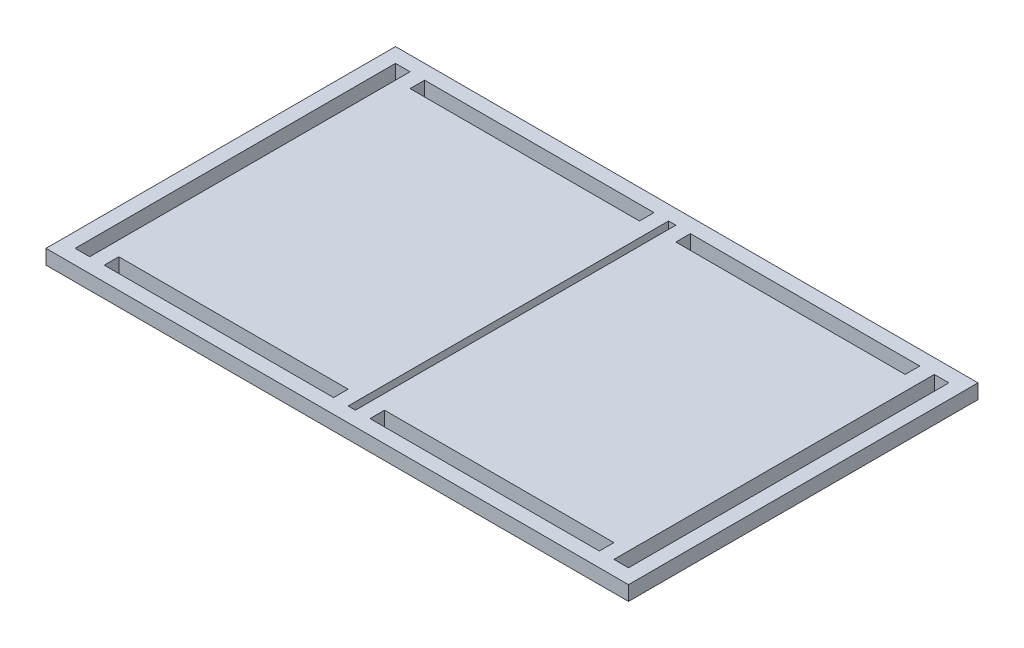
ISO-10303-21;
HEADER;
FILE_DESCRIPTION(('STEP AP214'),'2;1');
FILE_NAME('part.step','',(''),(''),'','','');
FILE_SCHEMA(('AUTOMOTIVE_DESIGN { 1 0 10303 214 1 1 1 1 }'));
ENDSEC;
DATA;
#1=APPLICATION_CONTEXT('core data for automotive mechanical design processes');
#2=APPLICATION_PROTOCOL_DEFINITION('international standard','automotive_design',2000,#1);
#3=PRODUCT_CONTEXT('',#1,'mechanical');
#4=PRODUCT('Part','Part','',(#3));
#5=PRODUCT_RELATED_PRODUCT_CATEGORY('part','',(#4));
#6=PRODUCT_DEFINITION_FORMATION('','',#4);
#7=PRODUCT_DEFINITION_CONTEXT('part definition',#1,'design');
#8=PRODUCT_DEFINITION('design','',#6,#7);
#9=PRODUCT_DEFINITION_SHAPE('','',#8);
#10=(LENGTH_UNIT() NAMED_UNIT(*) SI_UNIT(.MILLI.,.METRE.));
#11=(NAMED_UNIT(*) PLANE_ANGLE_UNIT() SI_UNIT($,.RADIAN.));
#12=(NAMED_UNIT(*) SI_UNIT($,.STERADIAN.) SOLID_ANGLE_UNIT());
#13=UNCERTAINTY_MEASURE_WITH_UNIT(LENGTH_MEASURE(1.E-05),#10,'distance_accuracy_value','');
#14=(GEOMETRIC_REPRESENTATION_CONTEXT(3) GLOBAL_UNCERTAINTY_ASSIGNED_CONTEXT((#13)) GLOBAL_UNIT_ASSIGNED_CONTEXT((#10,
#11,#12)) REPRESENTATION_CONTEXT('',''));
#15=CARTESIAN_POINT('',(0.,0.,0.));
#16=DIRECTION('',(0.,0.,1.));
#17=DIRECTION('',(1.,0.,0.));
#18=AXIS2_PLACEMENT_3D('',#15,#16,#17);
#19=CARTESIAN_POINT('',(-107.95,6.35,2.36111281758253E-13));
#20=DIRECTION('',(-1.,0.,0.));
#21=DIRECTION('',(0.,0.,1.));
#22=AXIS2_PLACEMENT_3D('',#19,#20,#21);
#23=PLANE('',#22);
#24=DIRECTION('',(0.,0.,-1.));
#25=VECTOR('',#24,1.);
#26=CARTESIAN_POINT('',(-107.95,0.,2.36111281758253E-13));
#27=LINE('',#26,#25);
#28=CARTESIAN_POINT('',(-107.95,0.,69.85));
#29=VERTEX_POINT('',#28);
#30=CARTESIAN_POINT('',(-107.95,0.,63.50508));
#31=VERTEX_POINT('',#30);
#32=EDGE_CURVE('E395',#29,#31,#27,.T.);
#33=ORIENTED_EDGE('',*,*,#32,.T.);
#34=DIRECTION('',(0.,-1.,0.));
#35=VECTOR('',#34,1.);
#36=CARTESIAN_POINT('',(-107.95,6.35,63.50508));
#37=LINE('',#36,#35);
#38=CARTESIAN_POINT('',(-107.95,6.35,63.50508));
#39=VERTEX_POINT('',#38);
#40=EDGE_CURVE('E11',#39,#31,#37,.T.);
#41=ORIENTED_EDGE('',*,*,#40,.F.);
#42=DIRECTION('',(0.,0.,-1.));
#43=VECTOR('',#42,1.);
#44=CARTESIAN_POINT('',(-107.95,6.35,2.36111281758253E-13));
#45=LINE('',#44,#43);
#46=CARTESIAN_POINT('',(-107.95,6.35,69.85));
#47=VERTEX_POINT('',#46);
#48=EDGE_CURVE('E263',#47,#39,#45,.T.);
#49=ORIENTED_EDGE('',*,*,#48,.F.);
#50=DIRECTION('',(0.,-1.,0.));
#51=VECTOR('',#50,1.);
#52=CARTESIAN_POINT('',(-107.95,6.35,69.85));
#53=LINE('',#52,#51);
#54=EDGE_CURVE('E59',#47,#29,#53,.T.);
#55=ORIENTED_EDGE('',*,*,#54,.T.);
#56=EDGE_LOOP('',(#33,#41,#49,#55));
#57=FACE_BOUND('',#56,.T.);
#58=ADVANCED_FACE('F39',(#57),#23,.F.);
#59=CARTESIAN_POINT('',(0.,6.35,63.50508));
#60=DIRECTION('',(0.,0.,-1.));
#61=DIRECTION('',(-1.,0.,0.));
#62=AXIS2_PLACEMENT_3D('',#59,#60,#61);
#63=PLANE('',#62);
#64=DIRECTION('',(1.,0.,0.));
#65=VECTOR('',#64,1.);
#66=CARTESIAN_POINT('',(0.,0.,63.50508));
#67=LINE('',#66,#65);
#68=CARTESIAN_POINT('',(-7.93750000000001,0.,63.50508));
#69=VERTEX_POINT('',#68);
#70=EDGE_CURVE('E270',#31,#69,#67,.T.);
#71=ORIENTED_EDGE('',*,*,#70,.T.);
#72=DIRECTION('',(0.,-1.,0.));
#73=VECTOR('',#72,1.);
#74=CARTESIAN_POINT('',(-7.93750000000001,6.35,63.50508));
#75=LINE('',#74,#73);
#76=CARTESIAN_POINT('',(-7.93750000000001,6.35,63.50508));
#77=VERTEX_POINT('',#76);
#78=EDGE_CURVE('E50',#77,#69,#75,.T.);
#79=ORIENTED_EDGE('',*,*,#78,.F.);
#80=DIRECTION('',(1.,0.,0.));
#81=VECTOR('',#80,1.);
#82=CARTESIAN_POINT('',(0.,6.35,63.50508));
#83=LINE('',#82,#81);
#84=EDGE_CURVE('E257',#39,#77,#83,.T.);
#85=ORIENTED_EDGE('',*,*,#84,.F.);
#86=ORIENTED_EDGE('',*,*,#40,.T.);
#87=EDGE_LOOP('',(#71,#79,#85,#86));
#88=FACE_BOUND('',#87,.T.);
#89=ADVANCED_FACE('F269',(#88),#63,.F.);
#90=CARTESIAN_POINT('',(-7.93749999999994,6.35,0.));
#91=DIRECTION('',(-1.,0.,0.));
#92=DIRECTION('',(0.,0.,1.));
#93=AXIS2_PLACEMENT_3D('',#90,#91,#92);
#94=PLANE('',#93);
#95=DIRECTION('',(0.,0.,-1.));
#96=VECTOR('',#95,1.);
#97=CARTESIAN_POINT('',(-7.93749999999994,0.,0.));
#98=LINE('',#97,#96);
#99=CARTESIAN_POINT('',(-7.93750000000001,0.,69.85));
#100=VERTEX_POINT('',#99);
#101=EDGE_CURVE('E400',#100,#69,#98,.T.);
#102=ORIENTED_EDGE('',*,*,#101,.F.);
#103=DIRECTION('',(0.,-1.,0.));
#104=VECTOR('',#103,1.);
#105=CARTESIAN_POINT('',(-7.93750000000001,6.35,69.85));
#106=LINE('',#105,#104);
#107=CARTESIAN_POINT('',(-7.93750000000001,6.35,69.85));
#108=VERTEX_POINT('',#107);
#109=EDGE_CURVE('E157',#108,#100,#106,.T.);
#110=ORIENTED_EDGE('',*,*,#109,.F.);
#111=DIRECTION('',(0.,0.,-1.));
#112=VECTOR('',#111,1.);
#113=CARTESIAN_POINT('',(-7.93749999999994,6.35,0.));
#114=LINE('',#113,#112);
#115=EDGE_CURVE('E262',#108,#77,#114,.T.);
#116=ORIENTED_EDGE('',*,*,#115,.T.);
#117=ORIENTED_EDGE('',*,*,#78,.T.);
#118=EDGE_LOOP('',(#102,#110,#116,#117));
#119=FACE_BOUND('',#118,.T.);
#120=ADVANCED_FACE('F275',(#119),#94,.T.);
#121=CARTESIAN_POINT('',(0.,6.35,63.51016));
#122=DIRECTION('',(0.,0.,-1.));
#123=DIRECTION('',(-1.,0.,0.));
#124=AXIS2_PLACEMENT_3D('',#121,#122,#123);
#125=PLANE('',#124);
#126=DIRECTION('',(1.,0.,0.));
#127=VECTOR('',#126,1.);
#128=CARTESIAN_POINT('',(0.,0.,63.51016));
#129=LINE('',#128,#127);
#130=CARTESIAN_POINT('',(7.93749999999999,0.,63.51016));
#131=VERTEX_POINT('',#130);
#132=CARTESIAN_POINT('',(107.95,0.,63.5101599999999));
#133=VERTEX_POINT('',#132);
#134=EDGE_CURVE('E379',#131,#133,#129,.T.);
#135=ORIENTED_EDGE('',*,*,#134,.T.);
#136=DIRECTION('',(0.,-1.,0.));
#137=VECTOR('',#136,1.);
#138=CARTESIAN_POINT('',(107.95,6.35,63.5101599999999));
#139=LINE('',#138,#137);
#140=CARTESIAN_POINT('',(107.95,6.35,63.5101599999999));
#141=VERTEX_POINT('',#140);
#142=EDGE_CURVE('E410',#141,#133,#139,.T.);
#143=ORIENTED_EDGE('',*,*,#142,.F.);
#144=DIRECTION('',(1.,0.,0.));
#145=VECTOR('',#144,1.);
#146=CARTESIAN_POINT('',(0.,6.35,63.51016));
#147=LINE('',#146,#145);
#148=CARTESIAN_POINT('',(7.93749999999999,6.35,63.51016));
#149=VERTEX_POINT('',#148);
#150=EDGE_CURVE('E601',#149,#141,#147,.T.);
#151=ORIENTED_EDGE('',*,*,#150,.F.);
#152=DIRECTION('',(0.,-1.,0.));
#153=VECTOR('',#152,1.);
#154=CARTESIAN_POINT('',(7.93749999999999,6.35,63.51016));
#155=LINE('',#154,#153);
#156=EDGE_CURVE('E413',#149,#131,#155,.T.);
#157=ORIENTED_EDGE('',*,*,#156,.T.);
#158=EDGE_LOOP('',(#135,#143,#151,#157));
#159=FACE_BOUND('',#158,.T.);
#160=ADVANCED_FACE('F632',(#159),#125,.F.);
#161=CARTESIAN_POINT('',(107.95,6.35,0.));
#162=DIRECTION('',(1.,0.,0.));
#163=DIRECTION('',(0.,0.,-1.));
#164=AXIS2_PLACEMENT_3D('',#161,#162,#163);
#165=PLANE('',#164);
#166=DIRECTION('',(0.,0.,1.));
#167=VECTOR('',#166,1.);
#168=CARTESIAN_POINT('',(107.95,0.,0.));
#169=LINE('',#168,#167);
#170=CARTESIAN_POINT('',(107.95,0.,69.85508));
#171=VERTEX_POINT('',#170);
#172=EDGE_CURVE('E383',#133,#171,#169,.T.);
#173=ORIENTED_EDGE('',*,*,#172,.T.);
#174=DIRECTION('',(0.,-1.,0.));
#175=VECTOR('',#174,1.);
#176=CARTESIAN_POINT('',(107.95,6.35,69.85508));
#177=LINE('',#176,#175);
#178=CARTESIAN_POINT('',(107.95,6.35,69.85508));
#179=VERTEX_POINT('',#178);
#180=EDGE_CURVE('E420',#179,#171,#177,.T.);
#181=ORIENTED_EDGE('',*,*,#180,.F.);
#182=DIRECTION('',(0.,0.,1.));
#183=VECTOR('',#182,1.);
#184=CARTESIAN_POINT('',(107.95,6.35,0.));
#185=LINE('',#184,#183);
#186=EDGE_CURVE('E605',#141,#179,#185,.T.);
#187=ORIENTED_EDGE('',*,*,#186,.F.);
#188=ORIENTED_EDGE('',*,*,#142,.T.);
#189=EDGE_LOOP('',(#173,#181,#187,#188));
#190=FACE_BOUND('',#189,.T.);
#191=ADVANCED_FACE('F634',(#190),#165,.F.);
#192=CARTESIAN_POINT('',(0.,6.35,69.85508));
#193=DIRECTION('',(0.,0.,-1.));
#194=DIRECTION('',(-1.,0.,0.));
#195=AXIS2_PLACEMENT_3D('',#192,#193,#194);
#196=PLANE('',#195);
#197=DIRECTION('',(1.,0.,0.));
#198=VECTOR('',#197,1.);
#199=CARTESIAN_POINT('',(0.,0.,69.85508));
#200=LINE('',#199,#198);
#201=CARTESIAN_POINT('',(7.93749999999999,0.,69.85508));
#202=VERTEX_POINT('',#201);
#203=EDGE_CURVE('E387',#202,#171,#200,.T.);
#204=ORIENTED_EDGE('',*,*,#203,.F.);
#205=DIRECTION('',(0.,-1.,0.));
#206=VECTOR('',#205,1.);
#207=CARTESIAN_POINT('',(7.93749999999999,6.35,69.85508));
#208=LINE('',#207,#206);
#209=CARTESIAN_POINT('',(7.93749999999999,6.35,69.85508));
#210=VERTEX_POINT('',#209);
#211=EDGE_CURVE('E416',#210,#202,#208,.T.);
#212=ORIENTED_EDGE('',*,*,#211,.F.);
#213=DIRECTION('',(1.,0.,0.));
#214=VECTOR('',#213,1.);
#215=CARTESIAN_POINT('',(0.,6.35,69.85508));
#216=LINE('',#215,#214);
#217=EDGE_CURVE('E608',#210,#179,#216,.T.);
#218=ORIENTED_EDGE('',*,*,#217,.T.);
#219=ORIENTED_EDGE('',*,*,#180,.T.);
#220=EDGE_LOOP('',(#204,#212,#218,#219));
#221=FACE_BOUND('',#220,.T.);
#222=ADVANCED_FACE('F627',(#221),#196,.T.);
#223=CARTESIAN_POINT('',(0.,6.35,-69.85));
#224=DIRECTION('',(0.,0.,-1.));
#225=DIRECTION('',(-1.,0.,0.));
#226=AXIS2_PLACEMENT_3D('',#223,#224,#225);
#227=PLANE('',#226);
#228=DIRECTION('',(1.,0.,0.));
#229=VECTOR('',#228,1.);
#230=CARTESIAN_POINT('',(0.,0.,-69.85));
#231=LINE('',#230,#229);
#232=CARTESIAN_POINT('',(-107.95,0.,-69.85));
#233=VERTEX_POINT('',#232);
#234=CARTESIAN_POINT('',(-7.93750000000001,0.,-69.85));
#235=VERTEX_POINT('',#234);
#236=EDGE_CURVE('E363',#233,#235,#231,.T.);
#237=ORIENTED_EDGE('',*,*,#236,.T.);
#238=DIRECTION('',(0.,-1.,0.));
#239=VECTOR('',#238,1.);
#240=CARTESIAN_POINT('',(-7.93750000000001,6.35,-69.85));
#241=LINE('',#240,#239);
#242=CARTESIAN_POINT('',(-7.93750000000001,6.35,-69.85));
#243=VERTEX_POINT('',#242);
#244=EDGE_CURVE('E417',#243,#235,#241,.T.);
#245=ORIENTED_EDGE('',*,*,#244,.F.);
#246=DIRECTION('',(1.,0.,0.));
#247=VECTOR('',#246,1.);
#248=CARTESIAN_POINT('',(0.,6.35,-69.85));
#249=LINE('',#248,#247);
#250=CARTESIAN_POINT('',(-107.95,6.35,-69.85));
#251=VERTEX_POINT('',#250);
#252=EDGE_CURVE('E586',#251,#243,#249,.T.);
#253=ORIENTED_EDGE('',*,*,#252,.F.);
#254=DIRECTION('',(0.,-1.,0.));
#255=VECTOR('',#254,1.);
#256=CARTESIAN_POINT('',(-107.95,6.35,-69.85));
#257=LINE('',#256,#255);
#258=EDGE_CURVE('E426',#251,#233,#257,.T.);
#259=ORIENTED_EDGE('',*,*,#258,.T.);
#260=EDGE_LOOP('',(#237,#245,#253,#259));
#261=FACE_BOUND('',#260,.T.);
#262=ADVANCED_FACE('F641',(#261),#227,.F.);
#263=CARTESIAN_POINT('',(-7.93749999999994,6.35,0.));
#264=DIRECTION('',(1.,0.,0.));
#265=DIRECTION('',(0.,0.,-1.));
#266=AXIS2_PLACEMENT_3D('',#263,#264,#265);
#267=PLANE('',#266);
#268=DIRECTION('',(0.,0.,1.));
#269=VECTOR('',#268,1.);
#270=CARTESIAN_POINT('',(-7.93749999999994,0.,0.));
#271=LINE('',#270,#269);
#272=CARTESIAN_POINT('',(-7.93750000000001,0.,-63.50508));
#273=VERTEX_POINT('',#272);
#274=EDGE_CURVE('E367',#235,#273,#271,.T.);
#275=ORIENTED_EDGE('',*,*,#274,.T.);
#276=DIRECTION('',(0.,-1.,0.));
#277=VECTOR('',#276,1.);
#278=CARTESIAN_POINT('',(-7.93750000000001,6.35,-63.50508));
#279=LINE('',#278,#277);
#280=CARTESIAN_POINT('',(-7.93750000000001,6.35,-63.50508));
#281=VERTEX_POINT('',#280);
#282=EDGE_CURVE('E433',#281,#273,#279,.T.);
#283=ORIENTED_EDGE('',*,*,#282,.F.);
#284=DIRECTION('',(0.,0.,1.));
#285=VECTOR('',#284,1.);
#286=CARTESIAN_POINT('',(-7.93749999999994,6.35,0.));
#287=LINE('',#286,#285);
#288=EDGE_CURVE('E590',#243,#281,#287,.T.);
#289=ORIENTED_EDGE('',*,*,#288,.F.);
#290=ORIENTED_EDGE('',*,*,#244,.T.);
#291=EDGE_LOOP('',(#275,#283,#289,#290));
#292=FACE_BOUND('',#291,.T.);
#293=ADVANCED_FACE('F735',(#292),#267,.F.);
#294=CARTESIAN_POINT('',(0.,6.35,-63.50508));
#295=DIRECTION('',(0.,0.,-1.));
#296=DIRECTION('',(-1.,0.,0.));
#297=AXIS2_PLACEMENT_3D('',#294,#295,#296);
#298=PLANE('',#297);
#299=DIRECTION('',(1.,0.,0.));
#300=VECTOR('',#299,1.);
#301=CARTESIAN_POINT('',(0.,0.,-63.50508));
#302=LINE('',#301,#300);
#303=CARTESIAN_POINT('',(-107.95,0.,-63.50508));
#304=VERTEX_POINT('',#303);
#305=EDGE_CURVE('E371',#304,#273,#302,.T.);
#306=ORIENTED_EDGE('',*,*,#305,.F.);
#307=DIRECTION('',(0.,-1.,0.));
#308=VECTOR('',#307,1.);
#309=CARTESIAN_POINT('',(-107.95,6.35,-63.50508));
#310=LINE('',#309,#308);
#311=CARTESIAN_POINT('',(-107.95,6.35,-63.50508));
#312=VERTEX_POINT('',#311);
#313=EDGE_CURVE('E429',#312,#304,#310,.T.);
#314=ORIENTED_EDGE('',*,*,#313,.F.);
#315=DIRECTION('',(1.,0.,0.));
#316=VECTOR('',#315,1.);
#317=CARTESIAN_POINT('',(0.,6.35,-63.50508));
#318=LINE('',#317,#316);
#319=EDGE_CURVE('E593',#312,#281,#318,.T.);
#320=ORIENTED_EDGE('',*,*,#319,.T.);
#321=ORIENTED_EDGE('',*,*,#282,.T.);
#322=EDGE_LOOP('',(#306,#314,#320,#321));
#323=FACE_BOUND('',#322,.T.);
#324=ADVANCED_FACE('F722',(#323),#298,.T.);
#325=CARTESIAN_POINT('',(-120.65,6.35,0.));
#326=DIRECTION('',(-1.,0.,0.));
#327=DIRECTION('',(0.,0.,1.));
#328=AXIS2_PLACEMENT_3D('',#325,#326,#327);
#329=PLANE('',#328);
#330=DIRECTION('',(0.,0.,-1.));
#331=VECTOR('',#330,1.);
#332=CARTESIAN_POINT('',(-120.65,0.,0.));
#333=LINE('',#332,#331);
#334=CARTESIAN_POINT('',(-120.65,0.,69.85));
#335=VERTEX_POINT('',#334);
#336=CARTESIAN_POINT('',(-120.65,0.,-69.85));
#337=VERTEX_POINT('',#336);
#338=EDGE_CURVE('E347',#335,#337,#333,.T.);
#339=ORIENTED_EDGE('',*,*,#338,.T.);
#340=DIRECTION('',(0.,-1.,0.));
#341=VECTOR('',#340,1.);
#342=CARTESIAN_POINT('',(-120.65,6.35,-69.85));
#343=LINE('',#342,#341);
#344=CARTESIAN_POINT('',(-120.65,6.35,-69.85));
#345=VERTEX_POINT('',#344);
#346=EDGE_CURVE('E430',#345,#337,#343,.T.);
#347=ORIENTED_EDGE('',*,*,#346,.F.);
#348=DIRECTION('',(0.,0.,-1.));
#349=VECTOR('',#348,1.);
#350=CARTESIAN_POINT('',(-120.65,6.35,0.));
#351=LINE('',#350,#349);
#352=CARTESIAN_POINT('',(-120.65,6.35,69.85));
#353=VERTEX_POINT('',#352);
#354=EDGE_CURVE('E571',#353,#345,#351,.T.);
#355=ORIENTED_EDGE('',*,*,#354,.F.);
#356=DIRECTION('',(0.,-1.,0.));
#357=VECTOR('',#356,1.);
#358=CARTESIAN_POINT('',(-120.65,6.35,69.85));
#359=LINE('',#358,#357);
#360=EDGE_CURVE('E439',#353,#335,#359,.T.);
#361=ORIENTED_EDGE('',*,*,#360,.T.);
#362=EDGE_LOOP('',(#339,#347,#355,#361));
#363=FACE_BOUND('',#362,.T.);
#364=ADVANCED_FACE('F718',(#363),#329,.F.);
#365=CARTESIAN_POINT('',(0.,6.35,-69.85));
#366=DIRECTION('',(0.,0.,-1.));
#367=DIRECTION('',(-1.,0.,0.));
#368=AXIS2_PLACEMENT_3D('',#365,#366,#367);
#369=PLANE('',#368);
#370=DIRECTION('',(1.,0.,0.));
#371=VECTOR('',#370,1.);
#372=CARTESIAN_POINT('',(0.,0.,-69.85));
#373=LINE('',#372,#371);
#374=CARTESIAN_POINT('',(-114.3,0.,-69.85));
#375=VERTEX_POINT('',#374);
#376=EDGE_CURVE('E351',#337,#375,#373,.T.);
#377=ORIENTED_EDGE('',*,*,#376,.T.);
#378=DIRECTION('',(0.,-1.,0.));
#379=VECTOR('',#378,1.);
#380=CARTESIAN_POINT('',(-114.3,6.35,-69.85));
#381=LINE('',#380,#379);
#382=CARTESIAN_POINT('',(-114.3,6.35,-69.85));
#383=VERTEX_POINT('',#382);
#384=EDGE_CURVE('E446',#383,#375,#381,.T.);
#385=ORIENTED_EDGE('',*,*,#384,.F.);
#386=DIRECTION('',(1.,0.,0.));
#387=VECTOR('',#386,1.);
#388=CARTESIAN_POINT('',(0.,6.35,-69.85));
#389=LINE('',#388,#387);
#390=EDGE_CURVE('E575',#345,#383,#389,.T.);
#391=ORIENTED_EDGE('',*,*,#390,.F.);
#392=ORIENTED_EDGE('',*,*,#346,.T.);
#393=EDGE_LOOP('',(#377,#385,#391,#392));
#394=FACE_BOUND('',#393,.T.);
#395=ADVANCED_FACE('F721',(#394),#369,.F.);
#396=CARTESIAN_POINT('',(-114.3,6.35,0.));
#397=DIRECTION('',(-1.,0.,0.));
#398=DIRECTION('',(0.,0.,1.));
#399=AXIS2_PLACEMENT_3D('',#396,#397,#398);
#400=PLANE('',#399);
#401=DIRECTION('',(0.,0.,-1.));
#402=VECTOR('',#401,1.);
#403=CARTESIAN_POINT('',(-114.3,0.,0.));
#404=LINE('',#403,#402);
#405=CARTESIAN_POINT('',(-114.3,0.,69.85));
#406=VERTEX_POINT('',#405);
#407=EDGE_CURVE('E355',#406,#375,#404,.T.);
#408=ORIENTED_EDGE('',*,*,#407,.F.);
#409=DIRECTION('',(0.,-1.,0.));
#410=VECTOR('',#409,1.);
#411=CARTESIAN_POINT('',(-114.3,6.35,69.85));
#412=LINE('',#411,#410);
#413=CARTESIAN_POINT('',(-114.3,6.35,69.85));
#414=VERTEX_POINT('',#413);
#415=EDGE_CURVE('E442',#414,#406,#412,.T.);
#416=ORIENTED_EDGE('',*,*,#415,.F.);
#417=DIRECTION('',(0.,0.,-1.));
#418=VECTOR('',#417,1.);
#419=CARTESIAN_POINT('',(-114.3,6.35,0.));
#420=LINE('',#419,#418);
#421=EDGE_CURVE('E578',#414,#383,#420,.T.);
#422=ORIENTED_EDGE('',*,*,#421,.T.);
#423=ORIENTED_EDGE('',*,*,#384,.T.);
#424=EDGE_LOOP('',(#408,#416,#422,#423));
#425=FACE_BOUND('',#424,.T.);
#426=ADVANCED_FACE('F707',(#425),#400,.T.);
#427=CARTESIAN_POINT('',(0.,6.35,69.8500000000001));
#428=DIRECTION('',(0.,0.,1.));
#429=DIRECTION('',(1.,0.,0.));
#430=AXIS2_PLACEMENT_3D('',#427,#428,#429);
#431=PLANE('',#430);
#432=DIRECTION('',(-1.,0.,0.));
#433=VECTOR('',#432,1.);
#434=CARTESIAN_POINT('',(0.,0.,69.8500000000001));
#435=LINE('',#434,#433);
#436=CARTESIAN_POINT('',(1.58749999999999,0.,69.8500000000001));
#437=VERTEX_POINT('',#436);
#438=CARTESIAN_POINT('',(-1.58750000000001,0.,69.8500000000001));
#439=VERTEX_POINT('',#438);
#440=EDGE_CURVE('E331',#437,#439,#435,.T.);
#441=ORIENTED_EDGE('',*,*,#440,.T.);
#442=DIRECTION('',(0.,-1.,0.));
#443=VECTOR('',#442,1.);
#444=CARTESIAN_POINT('',(-1.58750000000001,6.35,69.8500000000001));
#445=LINE('',#444,#443);
#446=CARTESIAN_POINT('',(-1.58750000000001,6.35,69.8500000000001));
#447=VERTEX_POINT('',#446);
#448=EDGE_CURVE('E443',#447,#439,#445,.T.);
#449=ORIENTED_EDGE('',*,*,#448,.F.);
#450=DIRECTION('',(-1.,0.,0.));
#451=VECTOR('',#450,1.);
#452=CARTESIAN_POINT('',(0.,6.35,69.8500000000001));
#453=LINE('',#452,#451);
#454=CARTESIAN_POINT('',(1.58749999999999,6.35,69.8500000000001));
#455=VERTEX_POINT('',#454);
#456=EDGE_CURVE('E556',#455,#447,#453,.T.);
#457=ORIENTED_EDGE('',*,*,#456,.F.);
#458=DIRECTION('',(0.,-1.,0.));
#459=VECTOR('',#458,1.);
#460=CARTESIAN_POINT('',(1.58749999999999,6.35,69.8500000000001));
#461=LINE('',#460,#459);
#462=EDGE_CURVE('E452',#455,#437,#461,.T.);
#463=ORIENTED_EDGE('',*,*,#462,.T.);
#464=EDGE_LOOP('',(#441,#449,#457,#463));
#465=FACE_BOUND('',#464,.T.);
#466=ADVANCED_FACE('F703',(#465),#431,.F.);
#467=CARTESIAN_POINT('',(-1.58750000000001,6.35,0.));
#468=DIRECTION('',(-1.,0.,0.));
#469=DIRECTION('',(0.,0.,1.));
#470=AXIS2_PLACEMENT_3D('',#467,#468,#469);
#471=PLANE('',#470);
#472=DIRECTION('',(0.,0.,-1.));
#473=VECTOR('',#472,1.);
#474=CARTESIAN_POINT('',(-1.58750000000001,0.,0.));
#475=LINE('',#474,#473);
#476=CARTESIAN_POINT('',(-1.58750000000001,0.,-69.85));
#477=VERTEX_POINT('',#476);
#478=EDGE_CURVE('E335',#439,#477,#475,.T.);
#479=ORIENTED_EDGE('',*,*,#478,.T.);
#480=DIRECTION('',(0.,-1.,0.));
#481=VECTOR('',#480,1.);
#482=CARTESIAN_POINT('',(-1.58750000000001,6.35,-69.85));
#483=LINE('',#482,#481);
#484=CARTESIAN_POINT('',(-1.58750000000001,6.35,-69.85));
#485=VERTEX_POINT('',#484);
#486=EDGE_CURVE('E459',#485,#477,#483,.T.);
#487=ORIENTED_EDGE('',*,*,#486,.F.);
#488=DIRECTION('',(0.,0.,-1.));
#489=VECTOR('',#488,1.);
#490=CARTESIAN_POINT('',(-1.58750000000001,6.35,0.));
#491=LINE('',#490,#489);
#492=EDGE_CURVE('E560',#447,#485,#491,.T.);
#493=ORIENTED_EDGE('',*,*,#492,.F.);
#494=ORIENTED_EDGE('',*,*,#448,.T.);
#495=EDGE_LOOP('',(#479,#487,#493,#494));
#496=FACE_BOUND('',#495,.T.);
#497=ADVANCED_FACE('F706',(#496),#471,.F.);
#498=CARTESIAN_POINT('',(0.,6.35,-69.85));
#499=DIRECTION('',(0.,0.,1.));
#500=DIRECTION('',(1.,0.,0.));
#501=AXIS2_PLACEMENT_3D('',#498,#499,#500);
#502=PLANE('',#501);
#503=DIRECTION('',(-1.,0.,0.));
#504=VECTOR('',#503,1.);
#505=CARTESIAN_POINT('',(0.,0.,-69.85));
#506=LINE('',#505,#504);
#507=CARTESIAN_POINT('',(1.58749999999999,0.,-69.85));
#508=VERTEX_POINT('',#507);
#509=EDGE_CURVE('E339',#508,#477,#506,.T.);
#510=ORIENTED_EDGE('',*,*,#509,.F.);
#511=DIRECTION('',(0.,-1.,0.));
#512=VECTOR('',#511,1.);
#513=CARTESIAN_POINT('',(1.58749999999999,6.35,-69.85));
#514=LINE('',#513,#512);
#515=CARTESIAN_POINT('',(1.58749999999999,6.35,-69.85));
#516=VERTEX_POINT('',#515);
#517=EDGE_CURVE('E455',#516,#508,#514,.T.);
#518=ORIENTED_EDGE('',*,*,#517,.F.);
#519=DIRECTION('',(-1.,0.,0.));
#520=VECTOR('',#519,1.);
#521=CARTESIAN_POINT('',(0.,6.35,-69.85));
#522=LINE('',#521,#520);
#523=EDGE_CURVE('E563',#516,#485,#522,.T.);
#524=ORIENTED_EDGE('',*,*,#523,.T.);
#525=ORIENTED_EDGE('',*,*,#486,.T.);
#526=EDGE_LOOP('',(#510,#518,#524,#525));
#527=FACE_BOUND('',#526,.T.);
#528=ADVANCED_FACE('F691',(#527),#502,.T.);
#529=CARTESIAN_POINT('',(3.05311331771917E-13,6.35,69.8500000000005));
#530=DIRECTION('',(0.,0.,1.));
#531=DIRECTION('',(1.,0.,0.));
#532=AXIS2_PLACEMENT_3D('',#529,#530,#531);
#533=PLANE('',#532);
#534=DIRECTION('',(-1.,0.,0.));
#535=VECTOR('',#534,1.);
#536=CARTESIAN_POINT('',(3.05311331771917E-13,0.,69.8500000000005));
#537=LINE('',#536,#535);
#538=CARTESIAN_POINT('',(120.65,0.,69.85));
#539=VERTEX_POINT('',#538);
#540=CARTESIAN_POINT('',(114.3,0.,69.85));
#541=VERTEX_POINT('',#540);
#542=EDGE_CURVE('E315',#539,#541,#537,.T.);
#543=ORIENTED_EDGE('',*,*,#542,.T.);
#544=DIRECTION('',(0.,-1.,0.));
#545=VECTOR('',#544,1.);
#546=CARTESIAN_POINT('',(114.3,6.35,69.85));
#547=LINE('',#546,#545);
#548=CARTESIAN_POINT('',(114.3,6.35,69.85));
#549=VERTEX_POINT('',#548);
#550=EDGE_CURVE('E456',#549,#541,#547,.T.);
#551=ORIENTED_EDGE('',*,*,#550,.F.);
#552=DIRECTION('',(-1.,0.,0.));
#553=VECTOR('',#552,1.);
#554=CARTESIAN_POINT('',(3.05311331771917E-13,6.35,69.8500000000005));
#555=LINE('',#554,#553);
#556=CARTESIAN_POINT('',(120.65,6.35,69.85));
#557=VERTEX_POINT('',#556);
#558=EDGE_CURVE('E541',#557,#549,#555,.T.);
#559=ORIENTED_EDGE('',*,*,#558,.F.);
#560=DIRECTION('',(0.,-1.,0.));
#561=VECTOR('',#560,1.);
#562=CARTESIAN_POINT('',(120.65,6.35,69.85));
#563=LINE('',#562,#561);
#564=EDGE_CURVE('E465',#557,#539,#563,.T.);
#565=ORIENTED_EDGE('',*,*,#564,.T.);
#566=EDGE_LOOP('',(#543,#551,#559,#565));
#567=FACE_BOUND('',#566,.T.);
#568=ADVANCED_FACE('F687',(#567),#533,.F.);
#569=CARTESIAN_POINT('',(114.3,6.35,0.));
#570=DIRECTION('',(-1.,0.,0.));
#571=DIRECTION('',(0.,0.,1.));
#572=AXIS2_PLACEMENT_3D('',#569,#570,#571);
#573=PLANE('',#572);
#574=DIRECTION('',(0.,0.,-1.));
#575=VECTOR('',#574,1.);
#576=CARTESIAN_POINT('',(114.3,0.,0.));
#577=LINE('',#576,#575);
#578=CARTESIAN_POINT('',(114.3,0.,-69.85));
#579=VERTEX_POINT('',#578);
#580=EDGE_CURVE('E319',#541,#579,#577,.T.);
#581=ORIENTED_EDGE('',*,*,#580,.T.);
#582=DIRECTION('',(0.,-1.,0.));
#583=VECTOR('',#582,1.);
#584=CARTESIAN_POINT('',(114.3,6.35,-69.85));
#585=LINE('',#584,#583);
#586=CARTESIAN_POINT('',(114.3,6.35,-69.85));
#587=VERTEX_POINT('',#586);
#588=EDGE_CURVE('E472',#587,#579,#585,.T.);
#589=ORIENTED_EDGE('',*,*,#588,.F.);
#590=DIRECTION('',(0.,0.,-1.));
#591=VECTOR('',#590,1.);
#592=CARTESIAN_POINT('',(114.3,6.35,0.));
#593=LINE('',#592,#591);
#594=EDGE_CURVE('E545',#549,#587,#593,.T.);
#595=ORIENTED_EDGE('',*,*,#594,.F.);
#596=ORIENTED_EDGE('',*,*,#550,.T.);
#597=EDGE_LOOP('',(#581,#589,#595,#596));
#598=FACE_BOUND('',#597,.T.);
#599=ADVANCED_FACE('F690',(#598),#573,.F.);
#600=CARTESIAN_POINT('',(-3.05311331771912E-13,6.35,-69.8499999999995));
#601=DIRECTION('',(0.,0.,1.));
#602=DIRECTION('',(1.,0.,0.));
#603=AXIS2_PLACEMENT_3D('',#600,#601,#602);
#604=PLANE('',#603);
#605=DIRECTION('',(-1.,0.,0.));
#606=VECTOR('',#605,1.);
#607=CARTESIAN_POINT('',(-3.05311331771912E-13,0.,-69.8499999999995));
#608=LINE('',#607,#606);
#609=CARTESIAN_POINT('',(120.65,0.,-69.85));
#610=VERTEX_POINT('',#609);
#611=EDGE_CURVE('E323',#610,#579,#608,.T.);
#612=ORIENTED_EDGE('',*,*,#611,.F.);
#613=DIRECTION('',(0.,-1.,0.));
#614=VECTOR('',#613,1.);
#615=CARTESIAN_POINT('',(120.65,6.35,-69.85));
#616=LINE('',#615,#614);
#617=CARTESIAN_POINT('',(120.65,6.35,-69.85));
#618=VERTEX_POINT('',#617);
#619=EDGE_CURVE('E468',#618,#610,#616,.T.);
#620=ORIENTED_EDGE('',*,*,#619,.F.);
#621=DIRECTION('',(-1.,0.,0.));
#622=VECTOR('',#621,1.);
#623=CARTESIAN_POINT('',(-3.05311331771912E-13,6.35,-69.8499999999995));
#624=LINE('',#623,#622);
#625=EDGE_CURVE('E548',#618,#587,#624,.T.);
#626=ORIENTED_EDGE('',*,*,#625,.T.);
#627=ORIENTED_EDGE('',*,*,#588,.T.);
#628=EDGE_LOOP('',(#612,#620,#626,#627));
#629=FACE_BOUND('',#628,.T.);
#630=ADVANCED_FACE('F674',(#629),#604,.T.);
#631=CARTESIAN_POINT('',(-127.,6.35,0.));
#632=DIRECTION('',(-1.,0.,0.));
#633=DIRECTION('',(0.,0.,1.));
#634=AXIS2_PLACEMENT_3D('',#631,#632,#633);
#635=PLANE('',#634);
#636=DIRECTION('',(0.,0.,-1.));
#637=VECTOR('',#636,1.);
#638=CARTESIAN_POINT('',(-127.,0.,0.));
#639=LINE('',#638,#637);
#640=CARTESIAN_POINT('',(-127.,0.,76.2));
#641=VERTEX_POINT('',#640);
#642=CARTESIAN_POINT('',(-127.,0.,-76.2));
#643=VERTEX_POINT('',#642);
#644=EDGE_CURVE('E299',#641,#643,#639,.T.);
#645=ORIENTED_EDGE('',*,*,#644,.F.);
#646=DIRECTION('',(0.,-1.,0.));
#647=VECTOR('',#646,1.);
#648=CARTESIAN_POINT('',(-127.,6.35,76.2));
#649=LINE('',#648,#647);
#650=CARTESIAN_POINT('',(-127.,6.35,76.2));
#651=VERTEX_POINT('',#650);
#652=EDGE_CURVE('E469',#651,#641,#649,.T.);
#653=ORIENTED_EDGE('',*,*,#652,.F.);
#654=DIRECTION('',(0.,0.,-1.));
#655=VECTOR('',#654,1.);
#656=CARTESIAN_POINT('',(-127.,6.35,0.));
#657=LINE('',#656,#655);
#658=CARTESIAN_POINT('',(-127.,6.35,-76.2));
#659=VERTEX_POINT('',#658);
#660=EDGE_CURVE('E520',#651,#659,#657,.T.);
#661=ORIENTED_EDGE('',*,*,#660,.T.);
#662=DIRECTION('',(0.,-1.,0.));
#663=VECTOR('',#662,1.);
#664=CARTESIAN_POINT('',(-127.,6.35,-76.2));
#665=LINE('',#664,#663);
#666=EDGE_CURVE('E478',#659,#643,#665,.T.);
#667=ORIENTED_EDGE('',*,*,#666,.T.);
#668=EDGE_LOOP('',(#645,#653,#661,#667));
#669=FACE_BOUND('',#668,.T.);
#670=ADVANCED_FACE('F670',(#669),#635,.T.);
#671=CARTESIAN_POINT('',(0.,6.35,76.2));
#672=DIRECTION('',(0.,0.,1.));
#673=DIRECTION('',(1.,0.,0.));
#674=AXIS2_PLACEMENT_3D('',#671,#672,#673);
#675=PLANE('',#674);
#676=DIRECTION('',(-1.,0.,0.));
#677=VECTOR('',#676,1.);
#678=CARTESIAN_POINT('',(0.,0.,76.2));
#679=LINE('',#678,#677);
#680=CARTESIAN_POINT('',(127.,0.,76.2));
#681=VERTEX_POINT('',#680);
#682=EDGE_CURVE('E303',#681,#641,#679,.T.);
#683=ORIENTED_EDGE('',*,*,#682,.F.);
#684=DIRECTION('',(0.,-1.,0.));
#685=VECTOR('',#684,1.);
#686=CARTESIAN_POINT('',(127.,6.35,76.2));
#687=LINE('',#686,#685);
#688=CARTESIAN_POINT('',(127.,6.35,76.2));
#689=VERTEX_POINT('',#688);
#690=EDGE_CURVE('E485',#689,#681,#687,.T.);
#691=ORIENTED_EDGE('',*,*,#690,.F.);
#692=DIRECTION('',(-1.,0.,0.));
#693=VECTOR('',#692,1.);
#694=CARTESIAN_POINT('',(0.,6.35,76.2));
#695=LINE('',#694,#693);
#696=EDGE_CURVE('E526',#689,#651,#695,.T.);
#697=ORIENTED_EDGE('',*,*,#696,.T.);
#698=ORIENTED_EDGE('',*,*,#652,.T.);
#699=EDGE_LOOP('',(#683,#691,#697,#698));
#700=FACE_BOUND('',#699,.T.);
#701=ADVANCED_FACE('F673',(#700),#675,.T.);
#702=CARTESIAN_POINT('',(127.,6.35,0.));
#703=DIRECTION('',(-1.,0.,0.));
#704=DIRECTION('',(0.,0.,1.));
#705=AXIS2_PLACEMENT_3D('',#702,#703,#704);
#706=PLANE('',#705);
#707=DIRECTION('',(0.,0.,-1.));
#708=VECTOR('',#707,1.);
#709=CARTESIAN_POINT('',(127.,0.,0.));
#710=LINE('',#709,#708);
#711=CARTESIAN_POINT('',(127.,0.,-76.2));
#712=VERTEX_POINT('',#711);
#713=EDGE_CURVE('E307',#681,#712,#710,.T.);
#714=ORIENTED_EDGE('',*,*,#713,.T.);
#715=DIRECTION('',(0.,-1.,0.));
#716=VECTOR('',#715,1.);
#717=CARTESIAN_POINT('',(127.,6.35,-76.2));
#718=LINE('',#717,#716);
#719=CARTESIAN_POINT('',(127.,6.35,-76.2));
#720=VERTEX_POINT('',#719);
#721=EDGE_CURVE('E481',#720,#712,#718,.T.);
#722=ORIENTED_EDGE('',*,*,#721,.F.);
#723=DIRECTION('',(0.,0.,-1.));
#724=VECTOR('',#723,1.);
#725=CARTESIAN_POINT('',(127.,6.35,0.));
#726=LINE('',#725,#724);
#727=EDGE_CURVE('E534',#689,#720,#726,.T.);
#728=ORIENTED_EDGE('',*,*,#727,.F.);
#729=ORIENTED_EDGE('',*,*,#690,.T.);
#730=EDGE_LOOP('',(#714,#722,#728,#729));
#731=FACE_BOUND('',#730,.T.);
#732=ADVANCED_FACE('F678',(#731),#706,.F.);
#733=CARTESIAN_POINT('',(107.95,6.35,0.));
#734=DIRECTION('',(-1.,0.,0.));
#735=DIRECTION('',(0.,0.,1.));
#736=AXIS2_PLACEMENT_3D('',#733,#734,#735);
#737=PLANE('',#736);
#738=DIRECTION('',(0.,0.,-1.));
#739=VECTOR('',#738,1.);
#740=CARTESIAN_POINT('',(107.95,0.,0.));
#741=LINE('',#740,#739);
#742=CARTESIAN_POINT('',(107.95,0.,-63.50508));
#743=VERTEX_POINT('',#742);
#744=CARTESIAN_POINT('',(107.95,0.,-69.85));
#745=VERTEX_POINT('',#744);
#746=EDGE_CURVE('E284',#743,#745,#741,.T.);
#747=ORIENTED_EDGE('',*,*,#746,.F.);
#748=DIRECTION('',(0.,-1.,0.));
#749=VECTOR('',#748,1.);
#750=CARTESIAN_POINT('',(107.95,6.35,-63.50508));
#751=LINE('',#750,#749);
#752=CARTESIAN_POINT('',(107.95,6.35,-63.50508));
#753=VERTEX_POINT('',#752);
#754=EDGE_CURVE('E43',#753,#743,#751,.T.);
#755=ORIENTED_EDGE('',*,*,#754,.F.);
#756=DIRECTION('',(0.,0.,-1.));
#757=VECTOR('',#756,1.);
#758=CARTESIAN_POINT('',(107.95,6.35,0.));
#759=LINE('',#758,#757);
#760=CARTESIAN_POINT('',(107.95,6.35,-69.85));
#761=VERTEX_POINT('',#760);
#762=EDGE_CURVE('E407',#753,#761,#759,.T.);
#763=ORIENTED_EDGE('',*,*,#762,.T.);
#764=DIRECTION('',(0.,-1.,0.));
#765=VECTOR('',#764,1.);
#766=CARTESIAN_POINT('',(107.95,6.35,-69.85));
#767=LINE('',#766,#765);
#768=EDGE_CURVE('E280',#761,#745,#767,.T.);
#769=ORIENTED_EDGE('',*,*,#768,.T.);
#770=EDGE_LOOP('',(#747,#755,#763,#769));
#771=FACE_BOUND('',#770,.T.);
#772=ADVANCED_FACE('F41',(#771),#737,.T.);
#773=CARTESIAN_POINT('',(0.,6.35,-63.50508));
#774=DIRECTION('',(0.,0.,-1.));
#775=DIRECTION('',(-1.,0.,0.));
#776=AXIS2_PLACEMENT_3D('',#773,#774,#775);
#777=PLANE('',#776);
#778=DIRECTION('',(1.,0.,0.));
#779=VECTOR('',#778,1.);
#780=CARTESIAN_POINT('',(0.,0.,-63.50508));
#781=LINE('',#780,#779);
#782=CARTESIAN_POINT('',(7.93749999999999,0.,-63.50508));
#783=VERTEX_POINT('',#782);
#784=EDGE_CURVE('E288',#783,#743,#781,.T.);
#785=ORIENTED_EDGE('',*,*,#784,.F.);
#786=DIRECTION('',(0.,-1.,0.));
#787=VECTOR('',#786,1.);
#788=CARTESIAN_POINT('',(7.93749999999999,6.35,-63.50508));
#789=LINE('',#788,#787);
#790=CARTESIAN_POINT('',(7.93749999999999,6.35,-63.50508));
#791=VERTEX_POINT('',#790);
#792=EDGE_CURVE('E495',#791,#783,#789,.T.);
#793=ORIENTED_EDGE('',*,*,#792,.F.);
#794=DIRECTION('',(1.,0.,0.));
#795=VECTOR('',#794,1.);
#796=CARTESIAN_POINT('',(0.,6.35,-63.50508));
#797=LINE('',#796,#795);
#798=EDGE_CURVE('E506',#791,#753,#797,.T.);
#799=ORIENTED_EDGE('',*,*,#798,.T.);
#800=ORIENTED_EDGE('',*,*,#754,.T.);
#801=EDGE_LOOP('',(#785,#793,#799,#800));
#802=FACE_BOUND('',#801,.T.);
#803=ADVANCED_FACE('F504',(#802),#777,.T.);
#804=CARTESIAN_POINT('',(7.93749999999999,6.35,0.));
#805=DIRECTION('',(-1.,0.,0.));
#806=DIRECTION('',(0.,0.,1.));
#807=AXIS2_PLACEMENT_3D('',#804,#805,#806);
#808=PLANE('',#807);
#809=DIRECTION('',(0.,0.,-1.));
#810=VECTOR('',#809,1.);
#811=CARTESIAN_POINT('',(7.93749999999999,0.,0.));
#812=LINE('',#811,#810);
#813=CARTESIAN_POINT('',(7.93749999999999,0.,-69.85));
#814=VERTEX_POINT('',#813);
#815=EDGE_CURVE('E292',#783,#814,#812,.T.);
#816=ORIENTED_EDGE('',*,*,#815,.T.);
#817=DIRECTION('',(0.,-1.,0.));
#818=VECTOR('',#817,1.);
#819=CARTESIAN_POINT('',(7.93749999999999,6.35,-69.85));
#820=LINE('',#819,#818);
#821=CARTESIAN_POINT('',(7.93749999999999,6.35,-69.85));
#822=VERTEX_POINT('',#821);
#823=EDGE_CURVE('E492',#822,#814,#820,.T.);
#824=ORIENTED_EDGE('',*,*,#823,.F.);
#825=DIRECTION('',(0.,0.,-1.));
#826=VECTOR('',#825,1.);
#827=CARTESIAN_POINT('',(7.93749999999999,6.35,0.));
#828=LINE('',#827,#826);
#829=EDGE_CURVE('E521',#791,#822,#828,.T.);
#830=ORIENTED_EDGE('',*,*,#829,.F.);
#831=ORIENTED_EDGE('',*,*,#792,.T.);
#832=EDGE_LOOP('',(#816,#824,#830,#831));
#833=FACE_BOUND('',#832,.T.);
#834=ADVANCED_FACE('F513',(#833),#808,.F.);
#835=CARTESIAN_POINT('',(7.93749999999997,6.35,0.));
#836=DIRECTION('',(1.,0.,0.));
#837=DIRECTION('',(0.,0.,-1.));
#838=AXIS2_PLACEMENT_3D('',#835,#836,#837);
#839=PLANE('',#838);
#840=DIRECTION('',(0.,0.,1.));
#841=VECTOR('',#840,1.);
#842=CARTESIAN_POINT('',(7.93749999999997,0.,0.));
#843=LINE('',#842,#841);
#844=EDGE_CURVE('E391',#131,#202,#843,.T.);
#845=ORIENTED_EDGE('',*,*,#844,.F.);
#846=ORIENTED_EDGE('',*,*,#156,.F.);
#847=DIRECTION('',(0.,0.,1.));
#848=VECTOR('',#847,1.);
#849=CARTESIAN_POINT('',(7.93749999999997,6.35,0.));
#850=LINE('',#849,#848);
#851=EDGE_CURVE('E612',#149,#210,#850,.T.);
#852=ORIENTED_EDGE('',*,*,#851,.T.);
#853=ORIENTED_EDGE('',*,*,#211,.T.);
#854=EDGE_LOOP('',(#845,#846,#852,#853));
#855=FACE_BOUND('',#854,.T.);
#856=ADVANCED_FACE('F619',(#855),#839,.T.);
#857=CARTESIAN_POINT('',(-107.95,6.35,0.));
#858=DIRECTION('',(1.,0.,0.));
#859=DIRECTION('',(0.,0.,-1.));
#860=AXIS2_PLACEMENT_3D('',#857,#858,#859);
#861=PLANE('',#860);
#862=DIRECTION('',(0.,0.,1.));
#863=VECTOR('',#862,1.);
#864=CARTESIAN_POINT('',(-107.95,0.,0.));
#865=LINE('',#864,#863);
#866=EDGE_CURVE('E375',#233,#304,#865,.T.);
#867=ORIENTED_EDGE('',*,*,#866,.F.);
#868=ORIENTED_EDGE('',*,*,#258,.F.);
#869=DIRECTION('',(0.,0.,1.));
#870=VECTOR('',#869,1.);
#871=CARTESIAN_POINT('',(-107.95,6.35,0.));
#872=LINE('',#871,#870);
#873=EDGE_CURVE('E597',#251,#312,#872,.T.);
#874=ORIENTED_EDGE('',*,*,#873,.T.);
#875=ORIENTED_EDGE('',*,*,#313,.T.);
#876=EDGE_LOOP('',(#867,#868,#874,#875));
#877=FACE_BOUND('',#876,.T.);
#878=ADVANCED_FACE('F653',(#877),#861,.T.);
#879=CARTESIAN_POINT('',(-3.05311331771922E-13,6.35,69.8500000000005));
#880=DIRECTION('',(0.,0.,-1.));
#881=DIRECTION('',(-1.,0.,0.));
#882=AXIS2_PLACEMENT_3D('',#879,#880,#881);
#883=PLANE('',#882);
#884=DIRECTION('',(1.,0.,0.));
#885=VECTOR('',#884,1.);
#886=CARTESIAN_POINT('',(-3.05311331771922E-13,0.,69.8500000000005));
#887=LINE('',#886,#885);
#888=EDGE_CURVE('E359',#335,#406,#887,.T.);
#889=ORIENTED_EDGE('',*,*,#888,.F.);
#890=ORIENTED_EDGE('',*,*,#360,.F.);
#891=DIRECTION('',(1.,0.,0.));
#892=VECTOR('',#891,1.);
#893=CARTESIAN_POINT('',(-3.05311331771922E-13,6.35,69.8500000000005));
#894=LINE('',#893,#892);
#895=EDGE_CURVE('E582',#353,#414,#894,.T.);
#896=ORIENTED_EDGE('',*,*,#895,.T.);
#897=ORIENTED_EDGE('',*,*,#415,.T.);
#898=EDGE_LOOP('',(#889,#890,#896,#897));
#899=FACE_BOUND('',#898,.T.);
#900=ADVANCED_FACE('F658',(#899),#883,.T.);
#901=CARTESIAN_POINT('',(1.58749999999999,6.35,0.));
#902=DIRECTION('',(-1.,0.,0.));
#903=DIRECTION('',(0.,0.,1.));
#904=AXIS2_PLACEMENT_3D('',#901,#902,#903);
#905=PLANE('',#904);
#906=DIRECTION('',(0.,0.,-1.));
#907=VECTOR('',#906,1.);
#908=CARTESIAN_POINT('',(1.58749999999999,0.,0.));
#909=LINE('',#908,#907);
#910=EDGE_CURVE('E343',#437,#508,#909,.T.);
#911=ORIENTED_EDGE('',*,*,#910,.F.);
#912=ORIENTED_EDGE('',*,*,#462,.F.);
#913=DIRECTION('',(0.,0.,-1.));
#914=VECTOR('',#913,1.);
#915=CARTESIAN_POINT('',(1.58749999999999,6.35,0.));
#916=LINE('',#915,#914);
#917=EDGE_CURVE('E567',#455,#516,#916,.T.);
#918=ORIENTED_EDGE('',*,*,#917,.T.);
#919=ORIENTED_EDGE('',*,*,#517,.T.);
#920=EDGE_LOOP('',(#911,#912,#918,#919));
#921=FACE_BOUND('',#920,.T.);
#922=ADVANCED_FACE('F701',(#921),#905,.T.);
#923=CARTESIAN_POINT('',(120.65,6.35,0.));
#924=DIRECTION('',(-1.,0.,0.));
#925=DIRECTION('',(0.,0.,1.));
#926=AXIS2_PLACEMENT_3D('',#923,#924,#925);
#927=PLANE('',#926);
#928=DIRECTION('',(0.,0.,-1.));
#929=VECTOR('',#928,1.);
#930=CARTESIAN_POINT('',(120.65,0.,0.));
#931=LINE('',#930,#929);
#932=EDGE_CURVE('E327',#539,#610,#931,.T.);
#933=ORIENTED_EDGE('',*,*,#932,.F.);
#934=ORIENTED_EDGE('',*,*,#564,.F.);
#935=DIRECTION('',(0.,0.,-1.));
#936=VECTOR('',#935,1.);
#937=CARTESIAN_POINT('',(120.65,6.35,0.));
#938=LINE('',#937,#936);
#939=EDGE_CURVE('E552',#557,#618,#938,.T.);
#940=ORIENTED_EDGE('',*,*,#939,.T.);
#941=ORIENTED_EDGE('',*,*,#619,.T.);
#942=EDGE_LOOP('',(#933,#934,#940,#941));
#943=FACE_BOUND('',#942,.T.);
#944=ADVANCED_FACE('F685',(#943),#927,.T.);
#945=CARTESIAN_POINT('',(0.,6.35,-76.2));
#946=DIRECTION('',(0.,0.,1.));
#947=DIRECTION('',(1.,0.,0.));
#948=AXIS2_PLACEMENT_3D('',#945,#946,#947);
#949=PLANE('',#948);
#950=DIRECTION('',(-1.,0.,0.));
#951=VECTOR('',#950,1.);
#952=CARTESIAN_POINT('',(0.,0.,-76.2));
#953=LINE('',#952,#951);
#954=EDGE_CURVE('E311',#712,#643,#953,.T.);
#955=ORIENTED_EDGE('',*,*,#954,.T.);
#956=ORIENTED_EDGE('',*,*,#666,.F.);
#957=DIRECTION('',(-1.,0.,0.));
#958=VECTOR('',#957,1.);
#959=CARTESIAN_POINT('',(0.,6.35,-76.2));
#960=LINE('',#959,#958);
#961=EDGE_CURVE('E538',#720,#659,#960,.T.);
#962=ORIENTED_EDGE('',*,*,#961,.F.);
#963=ORIENTED_EDGE('',*,*,#721,.T.);
#964=EDGE_LOOP('',(#955,#956,#962,#963));
#965=FACE_BOUND('',#964,.T.);
#966=ADVANCED_FACE('F669',(#965),#949,.F.);
#967=CARTESIAN_POINT('',(0.,6.35,-69.85));
#968=DIRECTION('',(0.,0.,-1.));
#969=DIRECTION('',(-1.,0.,0.));
#970=AXIS2_PLACEMENT_3D('',#967,#968,#969);
#971=PLANE('',#970);
#972=DIRECTION('',(1.,0.,0.));
#973=VECTOR('',#972,1.);
#974=CARTESIAN_POINT('',(0.,0.,-69.85));
#975=LINE('',#974,#973);
#976=EDGE_CURVE('E295',#814,#745,#975,.T.);
#977=ORIENTED_EDGE('',*,*,#976,.T.);
#978=ORIENTED_EDGE('',*,*,#768,.F.);
#979=DIRECTION('',(1.,0.,0.));
#980=VECTOR('',#979,1.);
#981=CARTESIAN_POINT('',(0.,6.35,-69.85));
#982=LINE('',#981,#980);
#983=EDGE_CURVE('E517',#822,#761,#982,.T.);
#984=ORIENTED_EDGE('',*,*,#983,.F.);
#985=ORIENTED_EDGE('',*,*,#823,.T.);
#986=EDGE_LOOP('',(#977,#978,#984,#985));
#987=FACE_BOUND('',#986,.T.);
#988=ADVANCED_FACE('F516',(#987),#971,.F.);
#989=CARTESIAN_POINT('',(0.,6.35,69.85));
#990=DIRECTION('',(0.,0.,-1.));
#991=DIRECTION('',(-1.,0.,0.));
#992=AXIS2_PLACEMENT_3D('',#989,#990,#991);
#993=PLANE('',#992);
#994=DIRECTION('',(1.,0.,0.));
#995=VECTOR('',#994,1.);
#996=CARTESIAN_POINT('',(0.,0.,69.85));
#997=LINE('',#996,#995);
#998=EDGE_CURVE('E403',#29,#100,#997,.T.);
#999=ORIENTED_EDGE('',*,*,#998,.F.);
#1000=ORIENTED_EDGE('',*,*,#54,.F.);
#1001=DIRECTION('',(1.,0.,0.));
#1002=VECTOR('',#1001,1.);
#1003=CARTESIAN_POINT('',(0.,6.35,69.85));
#1004=LINE('',#1003,#1002);
#1005=EDGE_CURVE('E277',#47,#108,#1004,.T.);
#1006=ORIENTED_EDGE('',*,*,#1005,.T.);
#1007=ORIENTED_EDGE('',*,*,#109,.T.);
#1008=EDGE_LOOP('',(#999,#1000,#1006,#1007));
#1009=FACE_BOUND('',#1008,.T.);
#1010=ADVANCED_FACE('F668',(#1009),#993,.T.);
#1011=CARTESIAN_POINT('',(0.,6.35,0.));
#1012=DIRECTION('',(0.,1.,0.));
#1013=DIRECTION('',(0.,0.,1.));
#1014=AXIS2_PLACEMENT_3D('',#1011,#1012,#1013);
#1015=PLANE('',#1014);
#1016=ORIENTED_EDGE('',*,*,#762,.F.);
#1017=ORIENTED_EDGE('',*,*,#798,.F.);
#1018=ORIENTED_EDGE('',*,*,#829,.T.);
#1019=ORIENTED_EDGE('',*,*,#983,.T.);
#1020=EDGE_LOOP('',(#1016,#1017,#1018,#1019));
#1021=FACE_BOUND('',#1020,.T.);
#1022=ORIENTED_EDGE('',*,*,#660,.F.);
#1023=ORIENTED_EDGE('',*,*,#696,.F.);
#1024=ORIENTED_EDGE('',*,*,#727,.T.);
#1025=ORIENTED_EDGE('',*,*,#961,.T.);
#1026=EDGE_LOOP('',(#1022,#1023,#1024,#1025));
#1027=FACE_BOUND('',#1026,.T.);
#1028=ORIENTED_EDGE('',*,*,#558,.T.);
#1029=ORIENTED_EDGE('',*,*,#594,.T.);
#1030=ORIENTED_EDGE('',*,*,#625,.F.);
#1031=ORIENTED_EDGE('',*,*,#939,.F.);
#1032=EDGE_LOOP('',(#1028,#1029,#1030,#1031));
#1033=FACE_BOUND('',#1032,.T.);
#1034=ORIENTED_EDGE('',*,*,#456,.T.);
#1035=ORIENTED_EDGE('',*,*,#492,.T.);
#1036=ORIENTED_EDGE('',*,*,#523,.F.);
#1037=ORIENTED_EDGE('',*,*,#917,.F.);
#1038=EDGE_LOOP('',(#1034,#1035,#1036,#1037));
#1039=FACE_BOUND('',#1038,.T.);
#1040=ORIENTED_EDGE('',*,*,#354,.T.);
#1041=ORIENTED_EDGE('',*,*,#390,.T.);
#1042=ORIENTED_EDGE('',*,*,#421,.F.);
#1043=ORIENTED_EDGE('',*,*,#895,.F.);
#1044=EDGE_LOOP('',(#1040,#1041,#1042,#1043));
#1045=FACE_BOUND('',#1044,.T.);
#1046=ORIENTED_EDGE('',*,*,#252,.T.);
#1047=ORIENTED_EDGE('',*,*,#288,.T.);
#1048=ORIENTED_EDGE('',*,*,#319,.F.);
#1049=ORIENTED_EDGE('',*,*,#873,.F.);
#1050=EDGE_LOOP('',(#1046,#1047,#1048,#1049));
#1051=FACE_BOUND('',#1050,.T.);
#1052=ORIENTED_EDGE('',*,*,#150,.T.);
#1053=ORIENTED_EDGE('',*,*,#186,.T.);
#1054=ORIENTED_EDGE('',*,*,#217,.F.);
#1055=ORIENTED_EDGE('',*,*,#851,.F.);
#1056=EDGE_LOOP('',(#1052,#1053,#1054,#1055));
#1057=FACE_BOUND('',#1056,.T.);
#1058=ORIENTED_EDGE('',*,*,#48,.T.);
#1059=ORIENTED_EDGE('',*,*,#84,.T.);
#1060=ORIENTED_EDGE('',*,*,#115,.F.);
#1061=ORIENTED_EDGE('',*,*,#1005,.F.);
#1062=EDGE_LOOP('',(#1058,#1059,#1060,#1061));
#1063=FACE_BOUND('',#1062,.T.);
#1064=ADVANCED_FACE('F259',(#1021,#1027,#1033,#1039,#1045,#1051,#1057,#1063),#1015,.T.);
#1065=CARTESIAN_POINT('',(0.,0.,0.));
#1066=DIRECTION('',(0.,1.,0.));
#1067=DIRECTION('',(0.,0.,1.));
#1068=AXIS2_PLACEMENT_3D('',#1065,#1066,#1067);
#1069=PLANE('',#1068);
#1070=ORIENTED_EDGE('',*,*,#746,.T.);
#1071=ORIENTED_EDGE('',*,*,#976,.F.);
#1072=ORIENTED_EDGE('',*,*,#815,.F.);
#1073=ORIENTED_EDGE('',*,*,#784,.T.);
#1074=EDGE_LOOP('',(#1070,#1071,#1072,#1073));
#1075=FACE_BOUND('',#1074,.T.);
#1076=ORIENTED_EDGE('',*,*,#644,.T.);
#1077=ORIENTED_EDGE('',*,*,#954,.F.);
#1078=ORIENTED_EDGE('',*,*,#713,.F.);
#1079=ORIENTED_EDGE('',*,*,#682,.T.);
#1080=EDGE_LOOP('',(#1076,#1077,#1078,#1079));
#1081=FACE_BOUND('',#1080,.T.);
#1082=ORIENTED_EDGE('',*,*,#542,.F.);
#1083=ORIENTED_EDGE('',*,*,#932,.T.);
#1084=ORIENTED_EDGE('',*,*,#611,.T.);
#1085=ORIENTED_EDGE('',*,*,#580,.F.);
#1086=EDGE_LOOP('',(#1082,#1083,#1084,#1085));
#1087=FACE_BOUND('',#1086,.T.);
#1088=ORIENTED_EDGE('',*,*,#440,.F.);
#1089=ORIENTED_EDGE('',*,*,#910,.T.);
#1090=ORIENTED_EDGE('',*,*,#509,.T.);
#1091=ORIENTED_EDGE('',*,*,#478,.F.);
#1092=EDGE_LOOP('',(#1088,#1089,#1090,#1091));
#1093=FACE_BOUND('',#1092,.T.);
#1094=ORIENTED_EDGE('',*,*,#338,.F.);
#1095=ORIENTED_EDGE('',*,*,#888,.T.);
#1096=ORIENTED_EDGE('',*,*,#407,.T.);
#1097=ORIENTED_EDGE('',*,*,#376,.F.);
#1098=EDGE_LOOP('',(#1094,#1095,#1096,#1097));
#1099=FACE_BOUND('',#1098,.T.);
#1100=ORIENTED_EDGE('',*,*,#236,.F.);
#1101=ORIENTED_EDGE('',*,*,#866,.T.);
#1102=ORIENTED_EDGE('',*,*,#305,.T.);
#1103=ORIENTED_EDGE('',*,*,#274,.F.);
#1104=EDGE_LOOP('',(#1100,#1101,#1102,#1103));
#1105=FACE_BOUND('',#1104,.T.);
#1106=ORIENTED_EDGE('',*,*,#134,.F.);
#1107=ORIENTED_EDGE('',*,*,#844,.T.);
#1108=ORIENTED_EDGE('',*,*,#203,.T.);
#1109=ORIENTED_EDGE('',*,*,#172,.F.);
#1110=EDGE_LOOP('',(#1106,#1107,#1108,#1109));
#1111=FACE_BOUND('',#1110,.T.);
#1112=ORIENTED_EDGE('',*,*,#32,.F.);
#1113=ORIENTED_EDGE('',*,*,#998,.T.);
#1114=ORIENTED_EDGE('',*,*,#101,.T.);
#1115=ORIENTED_EDGE('',*,*,#70,.F.);
#1116=EDGE_LOOP('',(#1112,#1113,#1114,#1115));
#1117=FACE_BOUND('',#1116,.T.);
#1118=ADVANCED_FACE('F510',(#1075,#1081,#1087,#1093,#1099,#1105,#1111,#1117),#1069,.F.);
#1119=CLOSED_SHELL('',(#58,#89,#120,#160,#191,#222,#262,#293,#324,#364,#395,#426,#466,#497,#528,
#568,#599,#630,#670,#701,#732,#772,#803,#834,#856,#878,#900,#922,#944,#966,#988,#1010,#1064,#1118));
#1120=MANIFOLD_SOLID_BREP('B2',#1119);
#1121=ADVANCED_BREP_SHAPE_REPRESENTATION('',(#18,#1120),#14);
#1122=SHAPE_DEFINITION_REPRESENTATION(#9,#1121);
ENDSEC;
END-ISO-10303-21;
